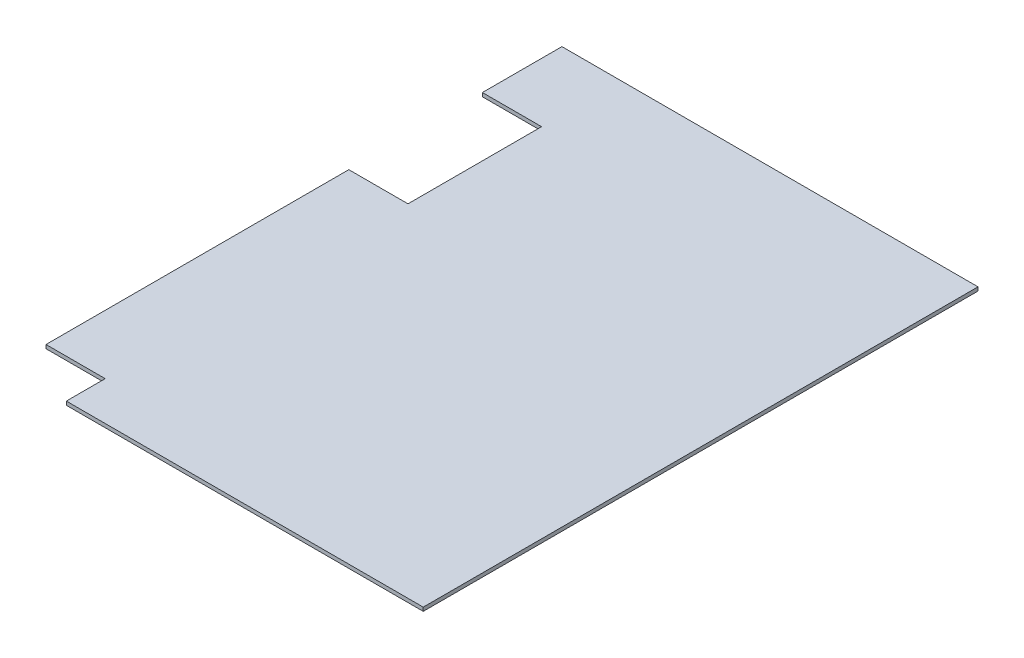
ISO-10303-21;
HEADER;
FILE_DESCRIPTION(('STEP AP214'),'2;1');
FILE_NAME('part.step','',(''),(''),'','','');
FILE_SCHEMA(('AUTOMOTIVE_DESIGN { 1 0 10303 214 1 1 1 1 }'));
ENDSEC;
DATA;
#1=APPLICATION_CONTEXT('core data for automotive mechanical design processes');
#2=APPLICATION_PROTOCOL_DEFINITION('international standard','automotive_design',2000,#1);
#3=PRODUCT_CONTEXT('',#1,'mechanical');
#4=PRODUCT('Part','Part','',(#3));
#5=PRODUCT_RELATED_PRODUCT_CATEGORY('part','',(#4));
#6=PRODUCT_DEFINITION_FORMATION('','',#4);
#7=PRODUCT_DEFINITION_CONTEXT('part definition',#1,'design');
#8=PRODUCT_DEFINITION('design','',#6,#7);
#9=PRODUCT_DEFINITION_SHAPE('','',#8);
#10=(LENGTH_UNIT() NAMED_UNIT(*) SI_UNIT(.MILLI.,.METRE.));
#11=(NAMED_UNIT(*) PLANE_ANGLE_UNIT() SI_UNIT($,.RADIAN.));
#12=(NAMED_UNIT(*) SI_UNIT($,.STERADIAN.) SOLID_ANGLE_UNIT());
#13=UNCERTAINTY_MEASURE_WITH_UNIT(LENGTH_MEASURE(1.E-05),#10,'distance_accuracy_value','');
#14=(GEOMETRIC_REPRESENTATION_CONTEXT(3) GLOBAL_UNCERTAINTY_ASSIGNED_CONTEXT((#13)) GLOBAL_UNIT_ASSIGNED_CONTEXT((#10,
#11,#12)) REPRESENTATION_CONTEXT('',''));
#15=CARTESIAN_POINT('',(0.,0.,0.));
#16=DIRECTION('',(0.,0.,1.));
#17=DIRECTION('',(1.,0.,0.));
#18=AXIS2_PLACEMENT_3D('',#15,#16,#17);
#19=CARTESIAN_POINT('',(-2044.7,50.8,0.));
#20=DIRECTION('',(-1.,0.,0.));
#21=DIRECTION('',(0.,0.,1.));
#22=AXIS2_PLACEMENT_3D('',#19,#20,#21);
#23=PLANE('',#22);
#24=DIRECTION('',(0.,0.,-1.));
#25=VECTOR('',#24,1.);
#26=CARTESIAN_POINT('',(-2044.7,0.,0.));
#27=LINE('',#26,#25);
#28=CARTESIAN_POINT('',(-2044.7,0.,3810.));
#29=VERTEX_POINT('',#28);
#30=CARTESIAN_POINT('',(-2044.7,0.,3276.6));
#31=VERTEX_POINT('',#30);
#32=EDGE_CURVE('E194',#29,#31,#27,.T.);
#33=ORIENTED_EDGE('',*,*,#32,.F.);
#34=DIRECTION('',(0.,-1.,0.));
#35=VECTOR('',#34,1.);
#36=CARTESIAN_POINT('',(-2044.7,50.8,3810.));
#37=LINE('',#36,#35);
#38=CARTESIAN_POINT('',(-2044.7,50.8,3810.));
#39=VERTEX_POINT('',#38);
#40=EDGE_CURVE('E11',#39,#29,#37,.T.);
#41=ORIENTED_EDGE('',*,*,#40,.F.);
#42=DIRECTION('',(0.,0.,-1.));
#43=VECTOR('',#42,1.);
#44=CARTESIAN_POINT('',(-2044.7,50.8,0.));
#45=LINE('',#44,#43);
#46=CARTESIAN_POINT('',(-2044.7,50.8,3276.6));
#47=VERTEX_POINT('',#46);
#48=EDGE_CURVE('E154',#39,#47,#45,.T.);
#49=ORIENTED_EDGE('',*,*,#48,.T.);
#50=DIRECTION('',(0.,-1.,0.));
#51=VECTOR('',#50,1.);
#52=CARTESIAN_POINT('',(-2044.7,50.8,3276.6));
#53=LINE('',#52,#51);
#54=EDGE_CURVE('E92',#47,#31,#53,.T.);
#55=ORIENTED_EDGE('',*,*,#54,.T.);
#56=EDGE_LOOP('',(#33,#41,#49,#55));
#57=FACE_BOUND('',#56,.T.);
#58=ADVANCED_FACE('F36',(#57),#23,.T.);
#59=CARTESIAN_POINT('',(3.45147054287613E-13,50.8,3810.));
#60=DIRECTION('',(0.,0.,1.));
#61=DIRECTION('',(1.,0.,0.));
#62=AXIS2_PLACEMENT_3D('',#59,#60,#61);
#63=PLANE('',#62);
#64=DIRECTION('',(-1.,0.,0.));
#65=VECTOR('',#64,1.);
#66=CARTESIAN_POINT('',(3.45147054287613E-13,0.,3810.));
#67=LINE('',#66,#65);
#68=CARTESIAN_POINT('',(2857.5,0.,3810.));
#69=VERTEX_POINT('',#68);
#70=EDGE_CURVE('E188',#69,#29,#67,.T.);
#71=ORIENTED_EDGE('',*,*,#70,.F.);
#72=DIRECTION('',(0.,-1.,0.));
#73=VECTOR('',#72,1.);
#74=CARTESIAN_POINT('',(2857.5,50.8,3810.));
#75=LINE('',#74,#73);
#76=CARTESIAN_POINT('',(2857.5,50.8,3810.));
#77=VERTEX_POINT('',#76);
#78=EDGE_CURVE('E44',#77,#69,#75,.T.);
#79=ORIENTED_EDGE('',*,*,#78,.F.);
#80=DIRECTION('',(-1.,0.,0.));
#81=VECTOR('',#80,1.);
#82=CARTESIAN_POINT('',(3.45147054287613E-13,50.8,3810.));
#83=LINE('',#82,#81);
#84=EDGE_CURVE('E149',#77,#39,#83,.T.);
#85=ORIENTED_EDGE('',*,*,#84,.T.);
#86=ORIENTED_EDGE('',*,*,#40,.T.);
#87=EDGE_LOOP('',(#71,#79,#85,#86));
#88=FACE_BOUND('',#87,.T.);
#89=ADVANCED_FACE('F193',(#88),#63,.T.);
#90=CARTESIAN_POINT('',(2857.5,50.8,0.));
#91=DIRECTION('',(-1.,0.,0.));
#92=DIRECTION('',(0.,0.,1.));
#93=AXIS2_PLACEMENT_3D('',#90,#91,#92);
#94=PLANE('',#93);
#95=DIRECTION('',(0.,0.,-1.));
#96=VECTOR('',#95,1.);
#97=CARTESIAN_POINT('',(2857.5,0.,0.));
#98=LINE('',#97,#96);
#99=CARTESIAN_POINT('',(2857.5,0.,-3810.));
#100=VERTEX_POINT('',#99);
#101=EDGE_CURVE('E180',#69,#100,#98,.T.);
#102=ORIENTED_EDGE('',*,*,#101,.T.);
#103=DIRECTION('',(0.,-1.,0.));
#104=VECTOR('',#103,1.);
#105=CARTESIAN_POINT('',(2857.5,50.8,-3810.));
#106=LINE('',#105,#104);
#107=CARTESIAN_POINT('',(2857.5,50.8,-3810.));
#108=VERTEX_POINT('',#107);
#109=EDGE_CURVE('E173',#108,#100,#106,.T.);
#110=ORIENTED_EDGE('',*,*,#109,.F.);
#111=DIRECTION('',(0.,0.,-1.));
#112=VECTOR('',#111,1.);
#113=CARTESIAN_POINT('',(2857.5,50.8,0.));
#114=LINE('',#113,#112);
#115=EDGE_CURVE('E146',#77,#108,#114,.T.);
#116=ORIENTED_EDGE('',*,*,#115,.F.);
#117=ORIENTED_EDGE('',*,*,#78,.T.);
#118=EDGE_LOOP('',(#102,#110,#116,#117));
#119=FACE_BOUND('',#118,.T.);
#120=ADVANCED_FACE('F178',(#119),#94,.F.);
#121=CARTESIAN_POINT('',(-2.96059473233375E-13,50.8,-3810.));
#122=DIRECTION('',(0.,0.,1.));
#123=DIRECTION('',(1.,0.,0.));
#124=AXIS2_PLACEMENT_3D('',#121,#122,#123);
#125=PLANE('',#124);
#126=DIRECTION('',(-1.,0.,0.));
#127=VECTOR('',#126,1.);
#128=CARTESIAN_POINT('',(-2.96059473233375E-13,0.,-3810.));
#129=LINE('',#128,#127);
#130=CARTESIAN_POINT('',(-2857.5,0.,-3810.));
#131=VERTEX_POINT('',#130);
#132=EDGE_CURVE('E191',#100,#131,#129,.T.);
#133=ORIENTED_EDGE('',*,*,#132,.T.);
#134=DIRECTION('',(0.,-1.,0.));
#135=VECTOR('',#134,1.);
#136=CARTESIAN_POINT('',(-2857.5,50.8,-3810.));
#137=LINE('',#136,#135);
#138=CARTESIAN_POINT('',(-2857.5,50.8,-3810.));
#139=VERTEX_POINT('',#138);
#140=EDGE_CURVE('E171',#139,#131,#137,.T.);
#141=ORIENTED_EDGE('',*,*,#140,.F.);
#142=DIRECTION('',(-1.,0.,0.));
#143=VECTOR('',#142,1.);
#144=CARTESIAN_POINT('',(-2.96059473233375E-13,50.8,-3810.));
#145=LINE('',#144,#143);
#146=EDGE_CURVE('E143',#108,#139,#145,.T.);
#147=ORIENTED_EDGE('',*,*,#146,.F.);
#148=ORIENTED_EDGE('',*,*,#109,.T.);
#149=EDGE_LOOP('',(#133,#141,#147,#148));
#150=FACE_BOUND('',#149,.T.);
#151=ADVANCED_FACE('F212',(#150),#125,.F.);
#152=CARTESIAN_POINT('',(-2857.5,50.8,0.));
#153=DIRECTION('',(-1.,0.,0.));
#154=DIRECTION('',(0.,0.,1.));
#155=AXIS2_PLACEMENT_3D('',#152,#153,#154);
#156=PLANE('',#155);
#157=DIRECTION('',(0.,0.,-1.));
#158=VECTOR('',#157,1.);
#159=CARTESIAN_POINT('',(-2857.5,0.,0.));
#160=LINE('',#159,#158);
#161=CARTESIAN_POINT('',(-2857.5,0.,-2717.8));
#162=VERTEX_POINT('',#161);
#163=EDGE_CURVE('E160',#162,#131,#160,.T.);
#164=ORIENTED_EDGE('',*,*,#163,.F.);
#165=DIRECTION('',(0.,-1.,0.));
#166=VECTOR('',#165,1.);
#167=CARTESIAN_POINT('',(-2857.5,50.8,-2717.8));
#168=LINE('',#167,#166);
#169=CARTESIAN_POINT('',(-2857.5,50.8,-2717.8));
#170=VERTEX_POINT('',#169);
#171=EDGE_CURVE('E169',#170,#162,#168,.T.);
#172=ORIENTED_EDGE('',*,*,#171,.F.);
#173=DIRECTION('',(0.,0.,-1.));
#174=VECTOR('',#173,1.);
#175=CARTESIAN_POINT('',(-2857.5,50.8,0.));
#176=LINE('',#175,#174);
#177=EDGE_CURVE('E137',#170,#139,#176,.T.);
#178=ORIENTED_EDGE('',*,*,#177,.T.);
#179=ORIENTED_EDGE('',*,*,#140,.T.);
#180=EDGE_LOOP('',(#164,#172,#178,#179));
#181=FACE_BOUND('',#180,.T.);
#182=ADVANCED_FACE('F217',(#181),#156,.T.);
#183=CARTESIAN_POINT('',(-1.48492329543615E-12,50.8,-2717.8));
#184=DIRECTION('',(0.,0.,-1.));
#185=DIRECTION('',(-1.,0.,0.));
#186=AXIS2_PLACEMENT_3D('',#183,#184,#185);
#187=PLANE('',#186);
#188=DIRECTION('',(1.,0.,0.));
#189=VECTOR('',#188,1.);
#190=CARTESIAN_POINT('',(-1.48492329543615E-12,0.,-2717.8));
#191=LINE('',#190,#189);
#192=CARTESIAN_POINT('',(-2044.7,0.,-2717.8));
#193=VERTEX_POINT('',#192);
#194=EDGE_CURVE('E199',#162,#193,#191,.T.);
#195=ORIENTED_EDGE('',*,*,#194,.T.);
#196=DIRECTION('',(0.,-1.,0.));
#197=VECTOR('',#196,1.);
#198=CARTESIAN_POINT('',(-2044.7,50.8,-2717.8));
#199=LINE('',#198,#197);
#200=CARTESIAN_POINT('',(-2044.7,50.8,-2717.8));
#201=VERTEX_POINT('',#200);
#202=EDGE_CURVE('E167',#201,#193,#199,.T.);
#203=ORIENTED_EDGE('',*,*,#202,.F.);
#204=DIRECTION('',(1.,0.,0.));
#205=VECTOR('',#204,1.);
#206=CARTESIAN_POINT('',(-1.48492329543615E-12,50.8,-2717.8));
#207=LINE('',#206,#205);
#208=EDGE_CURVE('E142',#170,#201,#207,.T.);
#209=ORIENTED_EDGE('',*,*,#208,.F.);
#210=ORIENTED_EDGE('',*,*,#171,.T.);
#211=EDGE_LOOP('',(#195,#203,#209,#210));
#212=FACE_BOUND('',#211,.T.);
#213=ADVANCED_FACE('F219',(#212),#187,.F.);
#214=CARTESIAN_POINT('',(-2044.7,50.8,4.94798358379655E-13));
#215=DIRECTION('',(-1.,0.,0.));
#216=DIRECTION('',(0.,0.,1.));
#217=AXIS2_PLACEMENT_3D('',#214,#215,#216);
#218=PLANE('',#217);
#219=DIRECTION('',(0.,0.,-1.));
#220=VECTOR('',#219,1.);
#221=CARTESIAN_POINT('',(-2044.7,0.,4.94798358379655E-13));
#222=LINE('',#221,#220);
#223=CARTESIAN_POINT('',(-2044.7,0.,-882.65));
#224=VERTEX_POINT('',#223);
#225=EDGE_CURVE('E201',#224,#193,#222,.T.);
#226=ORIENTED_EDGE('',*,*,#225,.F.);
#227=DIRECTION('',(0.,-1.,0.));
#228=VECTOR('',#227,1.);
#229=CARTESIAN_POINT('',(-2044.7,50.8,-882.65));
#230=LINE('',#229,#228);
#231=CARTESIAN_POINT('',(-2044.7,50.8,-882.65));
#232=VERTEX_POINT('',#231);
#233=EDGE_CURVE('E127',#232,#224,#230,.T.);
#234=ORIENTED_EDGE('',*,*,#233,.F.);
#235=DIRECTION('',(0.,0.,-1.));
#236=VECTOR('',#235,1.);
#237=CARTESIAN_POINT('',(-2044.7,50.8,4.94798358379655E-13));
#238=LINE('',#237,#236);
#239=EDGE_CURVE('E133',#232,#201,#238,.T.);
#240=ORIENTED_EDGE('',*,*,#239,.T.);
#241=ORIENTED_EDGE('',*,*,#202,.T.);
#242=EDGE_LOOP('',(#226,#234,#240,#241));
#243=FACE_BOUND('',#242,.T.);
#244=ADVANCED_FACE('F222',(#243),#218,.T.);
#245=CARTESIAN_POINT('',(-4.82253126321553E-13,50.8,-882.650000000001));
#246=DIRECTION('',(0.,0.,-1.));
#247=DIRECTION('',(-1.,0.,0.));
#248=AXIS2_PLACEMENT_3D('',#245,#246,#247);
#249=PLANE('',#248);
#250=DIRECTION('',(1.,0.,0.));
#251=VECTOR('',#250,1.);
#252=CARTESIAN_POINT('',(-4.82253126321553E-13,0.,-882.650000000001));
#253=LINE('',#252,#251);
#254=CARTESIAN_POINT('',(-2857.5,0.,-882.649999999999));
#255=VERTEX_POINT('',#254);
#256=EDGE_CURVE('E122',#255,#224,#253,.T.);
#257=ORIENTED_EDGE('',*,*,#256,.F.);
#258=DIRECTION('',(0.,-1.,0.));
#259=VECTOR('',#258,1.);
#260=CARTESIAN_POINT('',(-2857.5,50.8,-882.649999999999));
#261=LINE('',#260,#259);
#262=CARTESIAN_POINT('',(-2857.5,50.8,-882.649999999999));
#263=VERTEX_POINT('',#262);
#264=EDGE_CURVE('E117',#263,#255,#261,.T.);
#265=ORIENTED_EDGE('',*,*,#264,.F.);
#266=DIRECTION('',(1.,0.,0.));
#267=VECTOR('',#266,1.);
#268=CARTESIAN_POINT('',(-4.82253126321553E-13,50.8,-882.650000000001));
#269=LINE('',#268,#267);
#270=EDGE_CURVE('E120',#263,#232,#269,.T.);
#271=ORIENTED_EDGE('',*,*,#270,.T.);
#272=ORIENTED_EDGE('',*,*,#233,.T.);
#273=EDGE_LOOP('',(#257,#265,#271,#272));
#274=FACE_BOUND('',#273,.T.);
#275=ADVANCED_FACE('F119',(#274),#249,.T.);
#276=CARTESIAN_POINT('',(-2857.5,0.,3276.6));
#277=VERTEX_POINT('',#276);
#278=EDGE_CURVE('E156',#277,#255,#160,.T.);
#279=ORIENTED_EDGE('',*,*,#278,.F.);
#280=DIRECTION('',(0.,-1.,0.));
#281=VECTOR('',#280,1.);
#282=CARTESIAN_POINT('',(-2857.5,50.8,3276.6));
#283=LINE('',#282,#281);
#284=CARTESIAN_POINT('',(-2857.5,50.8,3276.6));
#285=VERTEX_POINT('',#284);
#286=EDGE_CURVE('E85',#285,#277,#283,.T.);
#287=ORIENTED_EDGE('',*,*,#286,.F.);
#288=EDGE_CURVE('E131',#285,#263,#176,.T.);
#289=ORIENTED_EDGE('',*,*,#288,.T.);
#290=ORIENTED_EDGE('',*,*,#264,.T.);
#291=EDGE_LOOP('',(#279,#287,#289,#290));
#292=FACE_BOUND('',#291,.T.);
#293=ADVANCED_FACE('F135',(#292),#156,.T.);
#294=CARTESIAN_POINT('',(0.,50.8,3276.6));
#295=DIRECTION('',(0.,0.,-1.));
#296=DIRECTION('',(-1.,0.,0.));
#297=AXIS2_PLACEMENT_3D('',#294,#295,#296);
#298=PLANE('',#297);
#299=DIRECTION('',(1.,0.,0.));
#300=VECTOR('',#299,1.);
#301=CARTESIAN_POINT('',(0.,0.,3276.6));
#302=LINE('',#301,#300);
#303=EDGE_CURVE('E155',#277,#31,#302,.T.);
#304=ORIENTED_EDGE('',*,*,#303,.T.);
#305=ORIENTED_EDGE('',*,*,#54,.F.);
#306=DIRECTION('',(1.,0.,0.));
#307=VECTOR('',#306,1.);
#308=CARTESIAN_POINT('',(0.,50.8,3276.6));
#309=LINE('',#308,#307);
#310=EDGE_CURVE('E52',#285,#47,#309,.T.);
#311=ORIENTED_EDGE('',*,*,#310,.F.);
#312=ORIENTED_EDGE('',*,*,#286,.T.);
#313=EDGE_LOOP('',(#304,#305,#311,#312));
#314=FACE_BOUND('',#313,.T.);
#315=ADVANCED_FACE('F231',(#314),#298,.F.);
#316=CARTESIAN_POINT('',(0.,50.8,0.));
#317=DIRECTION('',(0.,1.,0.));
#318=DIRECTION('',(0.,0.,1.));
#319=AXIS2_PLACEMENT_3D('',#316,#317,#318);
#320=PLANE('',#319);
#321=ORIENTED_EDGE('',*,*,#48,.F.);
#322=ORIENTED_EDGE('',*,*,#84,.F.);
#323=ORIENTED_EDGE('',*,*,#115,.T.);
#324=ORIENTED_EDGE('',*,*,#146,.T.);
#325=ORIENTED_EDGE('',*,*,#177,.F.);
#326=ORIENTED_EDGE('',*,*,#208,.T.);
#327=ORIENTED_EDGE('',*,*,#239,.F.);
#328=ORIENTED_EDGE('',*,*,#270,.F.);
#329=ORIENTED_EDGE('',*,*,#288,.F.);
#330=ORIENTED_EDGE('',*,*,#310,.T.);
#331=EDGE_LOOP('',(#321,#322,#323,#324,#325,#326,#327,#328,#329,#330));
#332=FACE_BOUND('',#331,.T.);
#333=ADVANCED_FACE('F130',(#332),#320,.T.);
#334=CARTESIAN_POINT('',(0.,0.,0.));
#335=DIRECTION('',(0.,1.,0.));
#336=DIRECTION('',(0.,0.,1.));
#337=AXIS2_PLACEMENT_3D('',#334,#335,#336);
#338=PLANE('',#337);
#339=ORIENTED_EDGE('',*,*,#32,.T.);
#340=ORIENTED_EDGE('',*,*,#303,.F.);
#341=ORIENTED_EDGE('',*,*,#278,.T.);
#342=ORIENTED_EDGE('',*,*,#256,.T.);
#343=ORIENTED_EDGE('',*,*,#225,.T.);
#344=ORIENTED_EDGE('',*,*,#194,.F.);
#345=ORIENTED_EDGE('',*,*,#163,.T.);
#346=ORIENTED_EDGE('',*,*,#132,.F.);
#347=ORIENTED_EDGE('',*,*,#101,.F.);
#348=ORIENTED_EDGE('',*,*,#70,.T.);
#349=EDGE_LOOP('',(#339,#340,#341,#342,#343,#344,#345,#346,#347,#348));
#350=FACE_BOUND('',#349,.T.);
#351=ADVANCED_FACE('F187',(#350),#338,.F.);
#352=CLOSED_SHELL('',(#58,#89,#120,#151,#182,#213,#244,#275,#293,#315,#333,#351));
#353=MANIFOLD_SOLID_BREP('B2',#352);
#354=ADVANCED_BREP_SHAPE_REPRESENTATION('',(#18,#353),#14);
#355=SHAPE_DEFINITION_REPRESENTATION(#9,#354);
ENDSEC;
END-ISO-10303-21;
